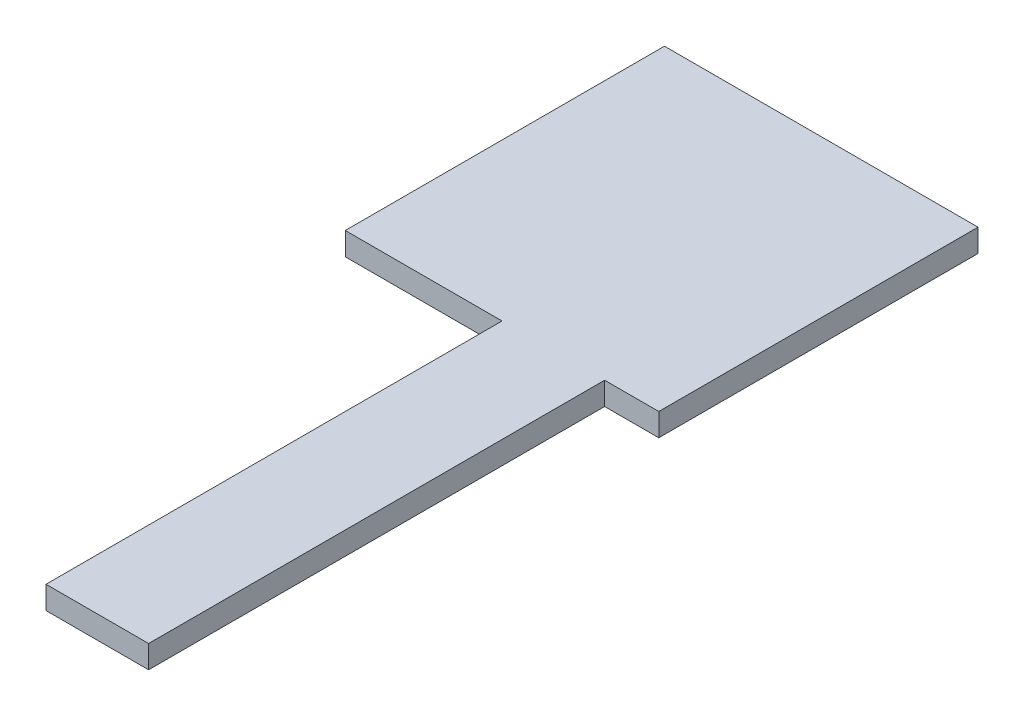
ISO-10303-21;
HEADER;
FILE_DESCRIPTION(('STEP AP214'),'2;1');
FILE_NAME('part.step','',(''),(''),'','','');
FILE_SCHEMA(('AUTOMOTIVE_DESIGN { 1 0 10303 214 1 1 1 1 }'));
ENDSEC;
DATA;
#1=APPLICATION_CONTEXT('core data for automotive mechanical design processes');
#2=APPLICATION_PROTOCOL_DEFINITION('international standard','automotive_design',2000,#1);
#3=PRODUCT_CONTEXT('',#1,'mechanical');
#4=PRODUCT('Part','Part','',(#3));
#5=PRODUCT_RELATED_PRODUCT_CATEGORY('part','',(#4));
#6=PRODUCT_DEFINITION_FORMATION('','',#4);
#7=PRODUCT_DEFINITION_CONTEXT('part definition',#1,'design');
#8=PRODUCT_DEFINITION('design','',#6,#7);
#9=PRODUCT_DEFINITION_SHAPE('','',#8);
#10=(LENGTH_UNIT() NAMED_UNIT(*) SI_UNIT(.MILLI.,.METRE.));
#11=(NAMED_UNIT(*) PLANE_ANGLE_UNIT() SI_UNIT($,.RADIAN.));
#12=(NAMED_UNIT(*) SI_UNIT($,.STERADIAN.) SOLID_ANGLE_UNIT());
#13=UNCERTAINTY_MEASURE_WITH_UNIT(LENGTH_MEASURE(1.E-05),#10,'distance_accuracy_value','');
#14=(GEOMETRIC_REPRESENTATION_CONTEXT(3) GLOBAL_UNCERTAINTY_ASSIGNED_CONTEXT((#13)) GLOBAL_UNIT_ASSIGNED_CONTEXT((#10,
#11,#12)) REPRESENTATION_CONTEXT('',''));
#15=CARTESIAN_POINT('',(0.,0.,0.));
#16=DIRECTION('',(0.,0.,1.));
#17=DIRECTION('',(1.,0.,0.));
#18=AXIS2_PLACEMENT_3D('',#15,#16,#17);
#19=CARTESIAN_POINT('',(-13.75,2.,14.));
#20=DIRECTION('',(0.,0.,-1.));
#21=DIRECTION('',(-1.,0.,0.));
#22=AXIS2_PLACEMENT_3D('',#19,#20,#21);
#23=PLANE('',#22);
#24=DIRECTION('',(0.,-1.,0.));
#25=VECTOR('',#24,1.);
#26=CARTESIAN_POINT('',(0.,0.,14.));
#27=LINE('',#26,#25);
#28=CARTESIAN_POINT('',(0.,2.,14.));
#29=VERTEX_POINT('',#28);
#30=CARTESIAN_POINT('',(0.,0.,14.));
#31=VERTEX_POINT('',#30);
#32=EDGE_CURVE('E48',#29,#31,#27,.T.);
#33=ORIENTED_EDGE('',*,*,#32,.F.);
#34=DIRECTION('',(1.,0.,0.));
#35=VECTOR('',#34,1.);
#36=CARTESIAN_POINT('',(-13.75,2.,14.));
#37=LINE('',#36,#35);
#38=CARTESIAN_POINT('',(-13.75,2.,14.));
#39=VERTEX_POINT('',#38);
#40=EDGE_CURVE('E140',#39,#29,#37,.T.);
#41=ORIENTED_EDGE('',*,*,#40,.F.);
#42=DIRECTION('',(0.,-1.,0.));
#43=VECTOR('',#42,1.);
#44=CARTESIAN_POINT('',(-13.75,2.,14.));
#45=LINE('',#44,#43);
#46=CARTESIAN_POINT('',(-13.75,0.,14.));
#47=VERTEX_POINT('',#46);
#48=EDGE_CURVE('E150',#39,#47,#45,.T.);
#49=ORIENTED_EDGE('',*,*,#48,.T.);
#50=DIRECTION('',(1.,0.,0.));
#51=VECTOR('',#50,1.);
#52=CARTESIAN_POINT('',(-13.75,0.,14.));
#53=LINE('',#52,#51);
#54=EDGE_CURVE('E135',#47,#31,#53,.T.);
#55=ORIENTED_EDGE('',*,*,#54,.T.);
#56=EDGE_LOOP('',(#33,#41,#49,#55));
#57=FACE_BOUND('',#56,.T.);
#58=ADVANCED_FACE('F33',(#57),#23,.F.);
#59=DIRECTION('',(0.,1.,0.));
#60=VECTOR('',#59,1.);
#61=CARTESIAN_POINT('',(9.,0.,14.));
#62=LINE('',#61,#60);
#63=CARTESIAN_POINT('',(9.,0.,14.));
#64=VERTEX_POINT('',#63);
#65=CARTESIAN_POINT('',(9.,2.,14.));
#66=VERTEX_POINT('',#65);
#67=EDGE_CURVE('E56',#64,#66,#62,.T.);
#68=ORIENTED_EDGE('',*,*,#67,.F.);
#69=CARTESIAN_POINT('',(13.75,0.,14.));
#70=VERTEX_POINT('',#69);
#71=EDGE_CURVE('E146',#64,#70,#53,.T.);
#72=ORIENTED_EDGE('',*,*,#71,.T.);
#73=DIRECTION('',(0.,-1.,0.));
#74=VECTOR('',#73,1.);
#75=CARTESIAN_POINT('',(13.75,2.,14.));
#76=LINE('',#75,#74);
#77=CARTESIAN_POINT('',(13.75,2.,14.));
#78=VERTEX_POINT('',#77);
#79=EDGE_CURVE('E141',#78,#70,#76,.T.);
#80=ORIENTED_EDGE('',*,*,#79,.F.);
#81=EDGE_CURVE('E139',#66,#78,#37,.T.);
#82=ORIENTED_EDGE('',*,*,#81,.F.);
#83=EDGE_LOOP('',(#68,#72,#80,#82));
#84=FACE_BOUND('',#83,.T.);
#85=ADVANCED_FACE('F175',(#84),#23,.F.);
#86=CARTESIAN_POINT('',(13.75,2.,14.));
#87=DIRECTION('',(-1.,0.,0.));
#88=DIRECTION('',(0.,0.,1.));
#89=AXIS2_PLACEMENT_3D('',#86,#87,#88);
#90=PLANE('',#89);
#91=DIRECTION('',(0.,0.,-1.));
#92=VECTOR('',#91,1.);
#93=CARTESIAN_POINT('',(13.75,0.,14.));
#94=LINE('',#93,#92);
#95=CARTESIAN_POINT('',(13.75,0.,-14.));
#96=VERTEX_POINT('',#95);
#97=EDGE_CURVE('E122',#70,#96,#94,.T.);
#98=ORIENTED_EDGE('',*,*,#97,.T.);
#99=DIRECTION('',(0.,-1.,0.));
#100=VECTOR('',#99,1.);
#101=CARTESIAN_POINT('',(13.75,2.,-14.));
#102=LINE('',#101,#100);
#103=CARTESIAN_POINT('',(13.75,2.,-14.));
#104=VERTEX_POINT('',#103);
#105=EDGE_CURVE('E11',#104,#96,#102,.T.);
#106=ORIENTED_EDGE('',*,*,#105,.F.);
#107=DIRECTION('',(0.,0.,-1.));
#108=VECTOR('',#107,1.);
#109=CARTESIAN_POINT('',(13.75,2.,14.));
#110=LINE('',#109,#108);
#111=EDGE_CURVE('E131',#78,#104,#110,.T.);
#112=ORIENTED_EDGE('',*,*,#111,.F.);
#113=ORIENTED_EDGE('',*,*,#79,.T.);
#114=EDGE_LOOP('',(#98,#106,#112,#113));
#115=FACE_BOUND('',#114,.T.);
#116=ADVANCED_FACE('F35',(#115),#90,.F.);
#117=CARTESIAN_POINT('',(-13.75,2.,-14.));
#118=DIRECTION('',(0.,0.,1.));
#119=DIRECTION('',(1.,0.,0.));
#120=AXIS2_PLACEMENT_3D('',#117,#118,#119);
#121=PLANE('',#120);
#122=DIRECTION('',(-1.,0.,0.));
#123=VECTOR('',#122,1.);
#124=CARTESIAN_POINT('',(-13.75,0.,-14.));
#125=LINE('',#124,#123);
#126=CARTESIAN_POINT('',(-13.75,0.,-14.));
#127=VERTEX_POINT('',#126);
#128=EDGE_CURVE('E125',#96,#127,#125,.T.);
#129=ORIENTED_EDGE('',*,*,#128,.T.);
#130=DIRECTION('',(0.,-1.,0.));
#131=VECTOR('',#130,1.);
#132=CARTESIAN_POINT('',(-13.75,2.,-14.));
#133=LINE('',#132,#131);
#134=CARTESIAN_POINT('',(-13.75,2.,-14.));
#135=VERTEX_POINT('',#134);
#136=EDGE_CURVE('E41',#135,#127,#133,.T.);
#137=ORIENTED_EDGE('',*,*,#136,.F.);
#138=DIRECTION('',(-1.,0.,0.));
#139=VECTOR('',#138,1.);
#140=CARTESIAN_POINT('',(-13.75,2.,-14.));
#141=LINE('',#140,#139);
#142=EDGE_CURVE('E134',#104,#135,#141,.T.);
#143=ORIENTED_EDGE('',*,*,#142,.F.);
#144=ORIENTED_EDGE('',*,*,#105,.T.);
#145=EDGE_LOOP('',(#129,#137,#143,#144));
#146=FACE_BOUND('',#145,.T.);
#147=ADVANCED_FACE('F177',(#146),#121,.F.);
#148=CARTESIAN_POINT('',(-13.75,2.,14.));
#149=DIRECTION('',(1.,0.,0.));
#150=DIRECTION('',(0.,0.,-1.));
#151=AXIS2_PLACEMENT_3D('',#148,#149,#150);
#152=PLANE('',#151);
#153=DIRECTION('',(0.,0.,1.));
#154=VECTOR('',#153,1.);
#155=CARTESIAN_POINT('',(-13.75,0.,14.));
#156=LINE('',#155,#154);
#157=EDGE_CURVE('E144',#127,#47,#156,.T.);
#158=ORIENTED_EDGE('',*,*,#157,.T.);
#159=ORIENTED_EDGE('',*,*,#48,.F.);
#160=DIRECTION('',(0.,0.,1.));
#161=VECTOR('',#160,1.);
#162=CARTESIAN_POINT('',(-13.75,2.,14.));
#163=LINE('',#162,#161);
#164=EDGE_CURVE('E137',#135,#39,#163,.T.);
#165=ORIENTED_EDGE('',*,*,#164,.F.);
#166=ORIENTED_EDGE('',*,*,#136,.T.);
#167=EDGE_LOOP('',(#158,#159,#165,#166));
#168=FACE_BOUND('',#167,.T.);
#169=ADVANCED_FACE('F157',(#168),#152,.F.);
#170=CARTESIAN_POINT('',(0.,2.,0.));
#171=DIRECTION('',(0.,-1.,0.));
#172=DIRECTION('',(0.,0.,-1.));
#173=AXIS2_PLACEMENT_3D('',#170,#171,#172);
#174=PLANE('',#173);
#175=ORIENTED_EDGE('',*,*,#111,.T.);
#176=ORIENTED_EDGE('',*,*,#142,.T.);
#177=ORIENTED_EDGE('',*,*,#164,.T.);
#178=ORIENTED_EDGE('',*,*,#40,.T.);
#179=DIRECTION('',(0.,0.,-1.));
#180=VECTOR('',#179,1.);
#181=CARTESIAN_POINT('',(0.,2.,54.));
#182=LINE('',#181,#180);
#183=CARTESIAN_POINT('',(0.,2.,54.));
#184=VERTEX_POINT('',#183);
#185=EDGE_CURVE('E162',#184,#29,#182,.T.);
#186=ORIENTED_EDGE('',*,*,#185,.F.);
#187=DIRECTION('',(-1.,0.,0.));
#188=VECTOR('',#187,1.);
#189=CARTESIAN_POINT('',(0.,2.,54.));
#190=LINE('',#189,#188);
#191=CARTESIAN_POINT('',(9.,2.,54.));
#192=VERTEX_POINT('',#191);
#193=EDGE_CURVE('E116',#192,#184,#190,.T.);
#194=ORIENTED_EDGE('',*,*,#193,.F.);
#195=DIRECTION('',(0.,0.,-1.));
#196=VECTOR('',#195,1.);
#197=CARTESIAN_POINT('',(9.,2.,54.));
#198=LINE('',#197,#196);
#199=EDGE_CURVE('E127',#192,#66,#198,.T.);
#200=ORIENTED_EDGE('',*,*,#199,.T.);
#201=ORIENTED_EDGE('',*,*,#81,.T.);
#202=EDGE_LOOP('',(#175,#176,#177,#178,#186,#194,#200,#201));
#203=FACE_BOUND('',#202,.T.);
#204=ADVANCED_FACE('F161',(#203),#174,.F.);
#205=CARTESIAN_POINT('',(0.,0.,0.));
#206=DIRECTION('',(0.,-1.,0.));
#207=DIRECTION('',(0.,0.,-1.));
#208=AXIS2_PLACEMENT_3D('',#205,#206,#207);
#209=PLANE('',#208);
#210=ORIENTED_EDGE('',*,*,#97,.F.);
#211=ORIENTED_EDGE('',*,*,#71,.F.);
#212=DIRECTION('',(0.,0.,-1.));
#213=VECTOR('',#212,1.);
#214=CARTESIAN_POINT('',(9.,0.,54.));
#215=LINE('',#214,#213);
#216=CARTESIAN_POINT('',(9.,0.,54.));
#217=VERTEX_POINT('',#216);
#218=EDGE_CURVE('E107',#217,#64,#215,.T.);
#219=ORIENTED_EDGE('',*,*,#218,.F.);
#220=DIRECTION('',(1.,0.,0.));
#221=VECTOR('',#220,1.);
#222=CARTESIAN_POINT('',(0.,0.,54.));
#223=LINE('',#222,#221);
#224=CARTESIAN_POINT('',(0.,0.,54.));
#225=VERTEX_POINT('',#224);
#226=EDGE_CURVE('E99',#225,#217,#223,.T.);
#227=ORIENTED_EDGE('',*,*,#226,.F.);
#228=DIRECTION('',(0.,0.,-1.));
#229=VECTOR('',#228,1.);
#230=CARTESIAN_POINT('',(0.,0.,54.));
#231=LINE('',#230,#229);
#232=EDGE_CURVE('E105',#225,#31,#231,.T.);
#233=ORIENTED_EDGE('',*,*,#232,.T.);
#234=ORIENTED_EDGE('',*,*,#54,.F.);
#235=ORIENTED_EDGE('',*,*,#157,.F.);
#236=ORIENTED_EDGE('',*,*,#128,.F.);
#237=EDGE_LOOP('',(#210,#211,#219,#227,#233,#234,#235,#236));
#238=FACE_BOUND('',#237,.T.);
#239=ADVANCED_FACE('F102',(#238),#209,.T.);
#240=CARTESIAN_POINT('',(0.,0.,54.));
#241=DIRECTION('',(1.,0.,0.));
#242=DIRECTION('',(0.,0.,-1.));
#243=AXIS2_PLACEMENT_3D('',#240,#241,#242);
#244=PLANE('',#243);
#245=ORIENTED_EDGE('',*,*,#32,.T.);
#246=ORIENTED_EDGE('',*,*,#232,.F.);
#247=DIRECTION('',(0.,-1.,0.));
#248=VECTOR('',#247,1.);
#249=CARTESIAN_POINT('',(0.,0.,54.));
#250=LINE('',#249,#248);
#251=EDGE_CURVE('E111',#184,#225,#250,.T.);
#252=ORIENTED_EDGE('',*,*,#251,.F.);
#253=ORIENTED_EDGE('',*,*,#185,.T.);
#254=EDGE_LOOP('',(#245,#246,#252,#253));
#255=FACE_BOUND('',#254,.T.);
#256=ADVANCED_FACE('F121',(#255),#244,.F.);
#257=CARTESIAN_POINT('',(9.,0.,54.));
#258=DIRECTION('',(-1.,0.,0.));
#259=DIRECTION('',(0.,0.,1.));
#260=AXIS2_PLACEMENT_3D('',#257,#258,#259);
#261=PLANE('',#260);
#262=ORIENTED_EDGE('',*,*,#67,.T.);
#263=ORIENTED_EDGE('',*,*,#199,.F.);
#264=DIRECTION('',(0.,1.,0.));
#265=VECTOR('',#264,1.);
#266=CARTESIAN_POINT('',(9.,0.,54.));
#267=LINE('',#266,#265);
#268=EDGE_CURVE('E110',#217,#192,#267,.T.);
#269=ORIENTED_EDGE('',*,*,#268,.F.);
#270=ORIENTED_EDGE('',*,*,#218,.T.);
#271=EDGE_LOOP('',(#262,#263,#269,#270));
#272=FACE_BOUND('',#271,.T.);
#273=ADVANCED_FACE('F171',(#272),#261,.F.);
#274=CARTESIAN_POINT('',(0.,0.,54.));
#275=DIRECTION('',(0.,0.,-1.));
#276=DIRECTION('',(-1.,0.,0.));
#277=AXIS2_PLACEMENT_3D('',#274,#275,#276);
#278=PLANE('',#277);
#279=ORIENTED_EDGE('',*,*,#251,.T.);
#280=ORIENTED_EDGE('',*,*,#226,.T.);
#281=ORIENTED_EDGE('',*,*,#268,.T.);
#282=ORIENTED_EDGE('',*,*,#193,.T.);
#283=EDGE_LOOP('',(#279,#280,#281,#282));
#284=FACE_BOUND('',#283,.T.);
#285=ADVANCED_FACE('F114',(#284),#278,.F.);
#286=CLOSED_SHELL('',(#58,#85,#116,#147,#169,#204,#239,#256,#273,#285));
#287=MANIFOLD_SOLID_BREP('B2',#286);
#288=ADVANCED_BREP_SHAPE_REPRESENTATION('',(#18,#287),#14);
#289=SHAPE_DEFINITION_REPRESENTATION(#9,#288);
ENDSEC;
END-ISO-10303-21;
